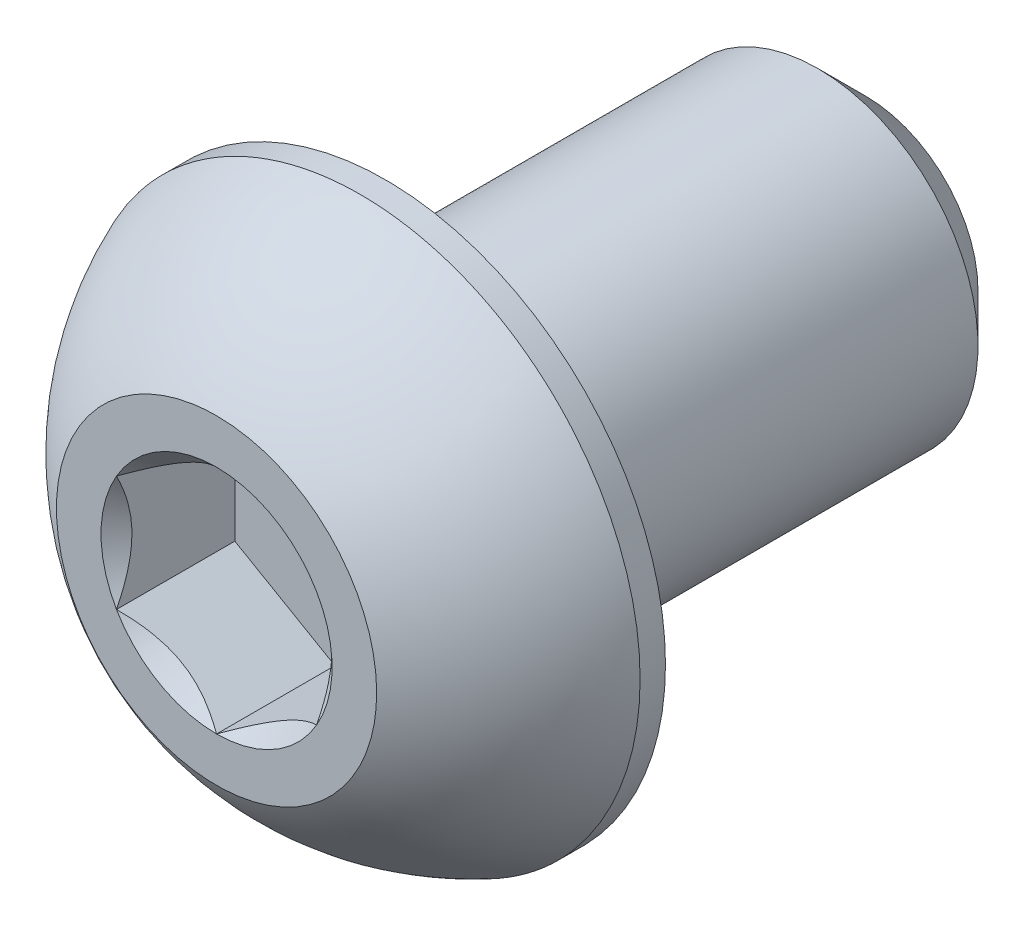
ISO-10303-21;
HEADER;
FILE_DESCRIPTION(('STEP AP214'),'2;1');
FILE_NAME('part.step','',(''),(''),'','','');
FILE_SCHEMA(('AUTOMOTIVE_DESIGN { 1 0 10303 214 1 1 1 1 }'));
ENDSEC;
DATA;
#1=APPLICATION_CONTEXT('core data for automotive mechanical design processes');
#2=APPLICATION_PROTOCOL_DEFINITION('international standard','automotive_design',2000,#1);
#3=PRODUCT_CONTEXT('',#1,'mechanical');
#4=PRODUCT('Part','Part','',(#3));
#5=PRODUCT_RELATED_PRODUCT_CATEGORY('part','',(#4));
#6=PRODUCT_DEFINITION_FORMATION('','',#4);
#7=PRODUCT_DEFINITION_CONTEXT('part definition',#1,'design');
#8=PRODUCT_DEFINITION('design','',#6,#7);
#9=PRODUCT_DEFINITION_SHAPE('','',#8);
#10=(LENGTH_UNIT() NAMED_UNIT(*) SI_UNIT(.MILLI.,.METRE.));
#11=(NAMED_UNIT(*) PLANE_ANGLE_UNIT() SI_UNIT($,.RADIAN.));
#12=(NAMED_UNIT(*) SI_UNIT($,.STERADIAN.) SOLID_ANGLE_UNIT());
#13=UNCERTAINTY_MEASURE_WITH_UNIT(LENGTH_MEASURE(1.E-05),#10,'distance_accuracy_value','');
#14=(GEOMETRIC_REPRESENTATION_CONTEXT(3) GLOBAL_UNCERTAINTY_ASSIGNED_CONTEXT((#13)) GLOBAL_UNIT_ASSIGNED_CONTEXT((#10,
#11,#12)) REPRESENTATION_CONTEXT('',''));
#15=CARTESIAN_POINT('',(0.,0.,0.));
#16=DIRECTION('',(0.,0.,1.));
#17=DIRECTION('',(1.,0.,0.));
#18=AXIS2_PLACEMENT_3D('',#15,#16,#17);
#19=CARTESIAN_POINT('',(1.98437500000015,-1.14567944042318,-2.34696));
#20=DIRECTION('',(0.,0.,1.));
#21=DIRECTION('',(1.,0.,0.));
#22=AXIS2_PLACEMENT_3D('',#19,#20,#21);
#23=PLANE('',#22);
#24=DIRECTION('',(0.,-1.,0.));
#25=VECTOR('',#24,1.);
#26=CARTESIAN_POINT('',(-1.98437500000001,1.14567944042318,-2.34696000000001));
#27=LINE('',#26,#25);
#28=CARTESIAN_POINT('',(-1.984375,1.14567944042315,-2.34696000000001));
#29=VERTEX_POINT('',#28);
#30=CARTESIAN_POINT('',(-1.98437500000001,-1.14567944042317,-2.34696000000001));
#31=VERTEX_POINT('',#30);
#32=EDGE_CURVE('E67',#29,#31,#27,.T.);
#33=ORIENTED_EDGE('',*,*,#32,.T.);
#34=DIRECTION('',(0.866025403784439,-0.5,0.));
#35=VECTOR('',#34,1.);
#36=CARTESIAN_POINT('',(-1.98437499999995,-1.14567944042318,-2.34696));
#37=LINE('',#36,#35);
#38=CARTESIAN_POINT('',(0.,-2.29135888084632,-2.34696));
#39=VERTEX_POINT('',#38);
#40=EDGE_CURVE('E81',#31,#39,#37,.T.);
#41=ORIENTED_EDGE('',*,*,#40,.T.);
#42=DIRECTION('',(0.866025403784438,0.500000000000001,0.));
#43=VECTOR('',#42,1.);
#44=CARTESIAN_POINT('',(0.,-2.29135888084632,-2.34696));
#45=LINE('',#44,#43);
#46=CARTESIAN_POINT('',(1.98437500000014,-1.14567944042314,-2.34696));
#47=VERTEX_POINT('',#46);
#48=EDGE_CURVE('E84',#39,#47,#45,.T.);
#49=ORIENTED_EDGE('',*,*,#48,.T.);
#50=DIRECTION('',(0.,1.,0.));
#51=VECTOR('',#50,1.);
#52=CARTESIAN_POINT('',(1.98437500000015,-1.14567944042318,-2.34696));
#53=LINE('',#52,#51);
#54=CARTESIAN_POINT('',(1.98437500000004,1.14567944042317,-2.34696));
#55=VERTEX_POINT('',#54);
#56=EDGE_CURVE('E94',#47,#55,#53,.T.);
#57=ORIENTED_EDGE('',*,*,#56,.T.);
#58=DIRECTION('',(-0.866025403784439,0.5,0.));
#59=VECTOR('',#58,1.);
#60=CARTESIAN_POINT('',(1.98437499999998,1.14567944042317,-2.34696));
#61=LINE('',#60,#59);
#62=CARTESIAN_POINT('',(0.,2.2913588808463,-2.34696000000001));
#63=VERTEX_POINT('',#62);
#64=EDGE_CURVE('E155',#55,#63,#61,.T.);
#65=ORIENTED_EDGE('',*,*,#64,.T.);
#66=DIRECTION('',(-0.866025403784438,-0.500000000000001,0.));
#67=VECTOR('',#66,1.);
#68=CARTESIAN_POINT('',(0.,2.29135888084633,-2.34696000000002));
#69=LINE('',#68,#67);
#70=EDGE_CURVE('E72',#63,#29,#69,.T.);
#71=ORIENTED_EDGE('',*,*,#70,.T.);
#72=EDGE_LOOP('',(#33,#41,#49,#57,#65,#71));
#73=FACE_BOUND('',#72,.T.);
#74=ADVANCED_FACE('F18',(#73),#23,.T.);
#75=CARTESIAN_POINT('',(-1.98437499999995,-1.14567944042318,-2.34696));
#76=DIRECTION('',(-0.5,-0.866025403784439,0.));
#77=DIRECTION('',(0.866025403784439,-0.5,0.));
#78=AXIS2_PLACEMENT_3D('',#75,#76,#77);
#79=PLANE('',#78);
#80=CARTESIAN_POINT('',(-1.98437499996113,-1.14567944044596,5.53590831692509E-11));
#81=CARTESIAN_POINT('',(-1.91617106208952,-1.1850570023357,-0.0393397719682902));
#82=CARTESIAN_POINT('',(-1.84682675297684,-1.22509295786858,-0.0763686714532534));
#83=CARTESIAN_POINT('',(-1.7054265904269,-1.30673037978017,-0.14416700563662));
#84=CARTESIAN_POINT('',(-1.63335729717463,-1.3483396056397,-0.174898729690736));
#85=CARTESIAN_POINT('',(-1.48803310239807,-1.43224256861373,-0.227542379771985));
#86=CARTESIAN_POINT('',(-1.41481519061645,-1.47451494969034,-0.249586587915512));
#87=CARTESIAN_POINT('',(-1.26676792251603,-1.5599900797809,-0.283549889195685));
#88=CARTESIAN_POINT('',(-1.19194308557701,-1.60319021952972,-0.295494325148714));
#89=CARTESIAN_POINT('',(-1.0629790320385,-1.67764765055596,-0.306271572343296));
#90=CARTESIAN_POINT('',(-1.00900630839731,-1.7088088170791,-0.307866471918129));
#91=CARTESIAN_POINT('',(-0.901149169201775,-1.77108016542767,-0.305176078479578));
#92=CARTESIAN_POINT('',(-0.847264791226896,-1.80219032555658,-0.300888724406291));
#93=CARTESIAN_POINT('',(-0.740004920177256,-1.86411684098033,-0.286677805648939));
#94=CARTESIAN_POINT('',(-0.686630064017393,-1.89493282855219,-0.276747939406714));
#95=CARTESIAN_POINT('',(-0.580803363116631,-1.95603190280469,-0.251797051416575));
#96=CARTESIAN_POINT('',(-0.528351447912644,-1.98631503016723,-0.236776420119124));
#97=CARTESIAN_POINT('',(-0.394030915897776,-2.0638650254837,-0.19219521086218));
#98=CARTESIAN_POINT('',(-0.312994309056721,-2.1106515322576,-0.15927786603087));
#99=CARTESIAN_POINT('',(-0.193836207809528,-2.17944749408879,-0.10371047949196));
#100=CARTESIAN_POINT('',(-0.154568167024551,-2.20211890800655,-0.0841869061260192));
#101=CARTESIAN_POINT('',(-0.076759172420062,-2.24704195198682,-0.0433602992331439));
#102=CARTESIAN_POINT('',(-0.0382177905088866,-2.26929382920818,-0.0220583562653107));
#103=CARTESIAN_POINT('',(-3.90387474774796E-11,-2.29135888082378,5.55226371469163E-11));
#104=B_SPLINE_CURVE_WITH_KNOTS('',3,(#80,#81,#82,#83,#84,#85,#86,#87,#88,#89,#90,#91,#92,#93,
#94,#95,#96,#97,#98,#99,#100,#101,#102,#103),.UNSPECIFIED.,.F.,.F.,(4,2,2,2,2,2,2,2,2,2,2,4),
(0.,0.264284909610382,0.530108996325592,0.791712695366179,1.05265800168076,1.2394215011033,
1.4262504565744,1.61328847387728,1.8003121490216,2.09727151171734,2.24534838932685,
2.39333511875249),.UNSPECIFIED.);
#105=CARTESIAN_POINT('',(-1.98437499996619,-1.14567944040367,3.90435785704199E-11));
#106=VERTEX_POINT('',#105);
#107=CARTESIAN_POINT('',(4.80738137425213E-11,-2.29135888079601,2.77548670291491E-11));
#108=VERTEX_POINT('',#107);
#109=EDGE_CURVE('E21',#106,#108,#104,.T.);
#110=ORIENTED_EDGE('',*,*,#109,.T.);
#111=DIRECTION('',(0.,0.,1.));
#112=VECTOR('',#111,1.);
#113=CARTESIAN_POINT('',(0.,-2.29135888084632,-2.34696));
#114=LINE('',#113,#112);
#115=EDGE_CURVE('E88',#108,#39,#114,.F.);
#116=ORIENTED_EDGE('',*,*,#115,.T.);
#117=ORIENTED_EDGE('',*,*,#40,.F.);
#118=DIRECTION('',(0.,0.,1.));
#119=VECTOR('',#118,1.);
#120=CARTESIAN_POINT('',(-1.98437500000001,-1.14567944042318,-2.34696000000001));
#121=LINE('',#120,#119);
#122=EDGE_CURVE('E59',#31,#106,#121,.T.);
#123=ORIENTED_EDGE('',*,*,#122,.T.);
#124=EDGE_LOOP('',(#110,#116,#117,#123));
#125=FACE_BOUND('',#124,.T.);
#126=ADVANCED_FACE('F89',(#125),#79,.F.);
#127=CARTESIAN_POINT('',(0.,-2.29135888084632,-2.34696));
#128=DIRECTION('',(0.500000000000001,-0.866025403784438,0.));
#129=DIRECTION('',(0.866025403784438,0.500000000000001,0.));
#130=AXIS2_PLACEMENT_3D('',#127,#128,#129);
#131=PLANE('',#130);
#132=CARTESIAN_POINT('',(3.91575770107944E-11,-2.29135888082407,5.53742249682677E-11));
#133=CARTESIAN_POINT('',(0.068203937910578,-2.25198131893398,-0.0393397719682822));
#134=CARTESIAN_POINT('',(0.137548247023185,-2.21194536340096,-0.0763686714532506));
#135=CARTESIAN_POINT('',(0.278948409573075,-2.13030794148925,-0.144167005636625));
#136=CARTESIAN_POINT('',(0.351017702825379,-2.08869871562975,-0.174898729690744));
#137=CARTESIAN_POINT('',(0.496341897601952,-2.00479575265575,-0.227542379771991));
#138=CARTESIAN_POINT('',(0.569559809383568,-1.96252337157913,-0.249586587915516));
#139=CARTESIAN_POINT('',(0.717607077483968,-1.87704824148857,-0.283549889195686));
#140=CARTESIAN_POINT('',(0.792431914422989,-1.83384810173976,-0.295494325148714));
#141=CARTESIAN_POINT('',(0.921395967961486,-1.75939067071352,-0.306271572343295));
#142=CARTESIAN_POINT('',(0.975368691602671,-1.72822950419038,-0.307866471918129));
#143=CARTESIAN_POINT('',(1.0832258307982,-1.66595815584182,-0.305176078479579));
#144=CARTESIAN_POINT('',(1.13711020877308,-1.63484799571291,-0.300888724406293));
#145=CARTESIAN_POINT('',(1.24437007982272,-1.57292148028915,-0.286677805648943));
#146=CARTESIAN_POINT('',(1.29774493598259,-1.5421054927173,-0.276747939406717));
#147=CARTESIAN_POINT('',(1.40357163688335,-1.48100641846479,-0.251797051416578));
#148=CARTESIAN_POINT('',(1.45602355208734,-1.45072329110226,-0.236776420119126));
#149=CARTESIAN_POINT('',(1.59034408410355,-1.37317329578501,-0.192195210861739));
#150=CARTESIAN_POINT('',(1.6713806909459,-1.32638678901036,-0.159277866029805));
#151=CARTESIAN_POINT('',(1.79053879219495,-1.2575908271781,-0.103710479489791));
#152=CARTESIAN_POINT('',(1.82980683298053,-1.23491941325999,-0.0841869061234554));
#153=CARTESIAN_POINT('',(1.90761582758621,-1.18999636927903,-0.0433602992297465));
#154=CARTESIAN_POINT('',(1.94615720949797,-1.16774449205734,-0.022058356261475));
#155=CARTESIAN_POINT('',(1.98437499996839,-1.1456794404414,5.98131242252754E-11));
#156=B_SPLINE_CURVE_WITH_KNOTS('',3,(#132,#133,#134,#135,#136,#137,#138,#139,#140,#141,#142,
#143,#144,#145,#146,#147,#148,#149,#150,#151,#152,#153,#154,#155),.UNSPECIFIED.,.F.,.F.,(4,2,2,
2,2,2,2,2,2,2,2,4),(0.,0.264284909610412,0.530108996325651,0.791712695366218,1.05265800168078,
1.23942150110331,1.4262504565744,1.61328847387729,1.80031214902162,2.09727151172217,
2.24534838933408,2.3933351187621),.UNSPECIFIED.);
#157=CARTESIAN_POINT('',(1.98437499998386,-1.14567944035432,2.96691945125649E-11));
#158=VERTEX_POINT('',#157);
#159=EDGE_CURVE('E199',#108,#158,#156,.T.);
#160=ORIENTED_EDGE('',*,*,#159,.T.);
#161=DIRECTION('',(0.,0.,1.));
#162=VECTOR('',#161,1.);
#163=CARTESIAN_POINT('',(1.98437500000015,-1.14567944042317,-2.34696));
#164=LINE('',#163,#162);
#165=EDGE_CURVE('E98',#158,#47,#164,.F.);
#166=ORIENTED_EDGE('',*,*,#165,.T.);
#167=ORIENTED_EDGE('',*,*,#48,.F.);
#168=ORIENTED_EDGE('',*,*,#115,.F.);
#169=EDGE_LOOP('',(#160,#166,#167,#168));
#170=FACE_BOUND('',#169,.T.);
#171=ADVANCED_FACE('F96',(#170),#131,.F.);
#172=CARTESIAN_POINT('',(1.98437500000015,-1.14567944042318,-2.34696));
#173=DIRECTION('',(1.,0.,0.));
#174=DIRECTION('',(0.,1.,0.));
#175=AXIS2_PLACEMENT_3D('',#172,#173,#174);
#176=PLANE('',#175);
#177=ORIENTED_EDGE('',*,*,#165,.F.);
#178=CARTESIAN_POINT('',(1.98437500000015,-1.14567944040829,1.39206491601629E-11));
#179=CARTESIAN_POINT('',(1.98437499999989,-1.06743880339701,-0.039083816313323));
#180=CARTESIAN_POINT('',(1.98437500000002,-0.987898318928285,-0.075885523088756));
#181=CARTESIAN_POINT('',(1.98437500000028,-0.825677042002386,-0.143343794927743));
#182=CARTESIAN_POINT('',(1.98437500000042,-0.742979382506015,-0.173959439319726));
#183=CARTESIAN_POINT('',(1.98437499999988,-0.575193959537607,-0.226826077097443));
#184=CARTESIAN_POINT('',(1.98437499999922,-0.490115359100477,-0.249105379119369));
#185=CARTESIAN_POINT('',(1.98437500000108,-0.318093091116875,-0.283405327707059));
#186=CARTESIAN_POINT('',(1.98437500000359,-0.231156054965337,-0.295457697637179));
#187=CARTESIAN_POINT('',(1.98437499999921,-0.119918521503129,-0.303508897285624));
#188=CARTESIAN_POINT('',(1.98437499999782,-0.0959468442982934,-0.304810524347571));
#189=CARTESIAN_POINT('',(1.98437500000248,-0.0479845644379657,-0.306548173625917));
#190=CARTESIAN_POINT('',(1.98437500000853,-0.0239939791573221,-0.306984666064257));
#191=CARTESIAN_POINT('',(1.98437500001843,0.0602201717453234,-0.306981909846599));
#192=CARTESIAN_POINT('',(1.98437500000515,0.120461721904622,-0.304225476926114));
#193=CARTESIAN_POINT('',(1.98437499999514,0.240474970988012,-0.293363448671785));
#194=CARTESIAN_POINT('',(1.98437499999841,0.300246312757291,-0.28525412242529));
#195=CARTESIAN_POINT('',(1.98437500000364,0.47876375280352,-0.253403770455282));
#196=CARTESIAN_POINT('',(1.98437500000096,0.596208828937264,-0.222145773806493));
#197=CARTESIAN_POINT('',(1.98437499999962,0.785921487432625,-0.158199964003356));
#198=CARTESIAN_POINT('',(1.98437499999988,0.859734609850088,-0.129765422243818));
#199=CARTESIAN_POINT('',(1.98437500000041,1.00456595515974,-0.0681385959297623));
#200=CARTESIAN_POINT('',(1.98437500000067,1.07560356652985,-0.0349922069391345));
#201=CARTESIAN_POINT('',(1.98437500000015,1.14567944039822,8.88291537603352E-12));
#202=B_SPLINE_CURVE_WITH_KNOTS('',3,(#178,#179,#180,#181,#182,#183,#184,#185,#186,#187,#188,
#189,#190,#191,#192,#193,#194,#195,#196,#197,#198,#199,#200,#201),.UNSPECIFIED.,.F.,.F.,(4,2,2,
2,2,2,2,2,2,2,2,4),(0.,0.262559005195411,0.526801735815133,0.790138824377003,1.05265603858338,
1.12466619178191,1.19663719494664,1.37727026722056,1.55802937204925,1.92104085085962,
2.15819130085229,2.39317265068751),.UNSPECIFIED.);
#203=CARTESIAN_POINT('',(1.98437499993238,1.14567944046219,1.06066558611253E-11));
#204=VERTEX_POINT('',#203);
#205=EDGE_CURVE('E177',#158,#204,#202,.T.);
#206=ORIENTED_EDGE('',*,*,#205,.T.);
#207=DIRECTION('',(0.,0.,1.));
#208=VECTOR('',#207,1.);
#209=CARTESIAN_POINT('',(1.98437499999998,1.14567944042317,-2.34696));
#210=LINE('',#209,#208);
#211=EDGE_CURVE('E152',#204,#55,#210,.F.);
#212=ORIENTED_EDGE('',*,*,#211,.T.);
#213=ORIENTED_EDGE('',*,*,#56,.F.);
#214=EDGE_LOOP('',(#177,#206,#212,#213));
#215=FACE_BOUND('',#214,.T.);
#216=ADVANCED_FACE('F176',(#215),#176,.F.);
#217=CARTESIAN_POINT('',(1.98437499999998,1.14567944042317,-2.34696));
#218=DIRECTION('',(0.5,0.866025403784439,0.));
#219=DIRECTION('',(-0.866025403784439,0.5,0.));
#220=AXIS2_PLACEMENT_3D('',#217,#218,#219);
#221=PLANE('',#220);
#222=CARTESIAN_POINT('',(1.98437499996299,1.14567944045163,5.15505898264042E-11));
#223=CARTESIAN_POINT('',(1.9161710620888,1.18505700233854,-0.0393397719703968));
#224=CARTESIAN_POINT('',(1.84682675297503,1.22509295787027,-0.07636867145463));
#225=CARTESIAN_POINT('',(1.7054265904242,1.30673037978107,-0.144167005637394));
#226=CARTESIAN_POINT('',(1.63335729717213,1.34833960564097,-0.174898729691639));
#227=CARTESIAN_POINT('',(1.48803310239559,1.43224256861534,-0.227542379772883));
#228=CARTESIAN_POINT('',(1.41481519061377,1.47451494969193,-0.249586587916278));
#229=CARTESIAN_POINT('',(1.2667679225131,1.55999007978255,-0.2835498891962));
#230=CARTESIAN_POINT('',(1.19194308557401,1.60319021953144,-0.295494325149112));
#231=CARTESIAN_POINT('',(1.06297903203536,1.67764765055779,-0.306271572343449));
#232=CARTESIAN_POINT('',(1.0090063083941,1.70880881708096,-0.307866471918167));
#233=CARTESIAN_POINT('',(0.901149169198434,1.7710801654296,-0.305176078479373));
#234=CARTESIAN_POINT('',(0.847264791223494,1.80219032555854,-0.300888724405961));
#235=CARTESIAN_POINT('',(0.740004920173754,1.86411684098236,-0.286677805648352));
#236=CARTESIAN_POINT('',(0.68663006401385,1.89493282855423,-0.276747939405996));
#237=CARTESIAN_POINT('',(0.580803363113016,1.95603190280678,-0.251797051415601));
#238=CARTESIAN_POINT('',(0.528351447908998,1.98631503016933,-0.236776420118024));
#239=CARTESIAN_POINT('',(0.394030915894765,2.06386502548544,-0.192195210861));
#240=CARTESIAN_POINT('',(0.312994309054356,2.11065153225897,-0.159277866029836));
#241=CARTESIAN_POINT('',(0.193836207808087,2.17944749408963,-0.10371047949125));
#242=CARTESIAN_POINT('',(0.154568167023408,2.20211890800721,-0.0841869061254333));
#243=CARTESIAN_POINT('',(0.0767591724195024,2.24704195198715,-0.0433602992328332));
#244=CARTESIAN_POINT('',(0.0382177905086133,2.26929382920834,-0.0220583562651516));
#245=CARTESIAN_POINT('',(3.9047189461392E-11,2.29135888082378,5.55197019446748E-11));
#246=B_SPLINE_CURVE_WITH_KNOTS('',3,(#222,#223,#224,#225,#226,#227,#228,#229,#230,#231,#232,
#233,#234,#235,#236,#237,#238,#239,#240,#241,#242,#243,#244,#245),.UNSPECIFIED.,.F.,.F.,(4,2,2,
2,2,2,2,2,2,2,2,4),(0.,0.264284909610474,0.530108996325887,0.791712695366782,1.05265800168162,
1.23942150110438,1.42625045657572,1.6132884738788,1.80031214902332,2.09727151171681,
2.24534838932523,2.39333511874978),.UNSPECIFIED.);
#247=CARTESIAN_POINT('',(-4.80404261260634E-11,2.29135888079601,2.77535217673844E-11));
#248=VERTEX_POINT('',#247);
#249=EDGE_CURVE('E182',#204,#248,#246,.T.);
#250=ORIENTED_EDGE('',*,*,#249,.T.);
#251=DIRECTION('',(0.,0.,1.));
#252=VECTOR('',#251,1.);
#253=CARTESIAN_POINT('',(0.,2.29135888084629,-2.34696000000002));
#254=LINE('',#253,#252);
#255=EDGE_CURVE('E147',#248,#63,#254,.F.);
#256=ORIENTED_EDGE('',*,*,#255,.T.);
#257=ORIENTED_EDGE('',*,*,#64,.F.);
#258=ORIENTED_EDGE('',*,*,#211,.F.);
#259=EDGE_LOOP('',(#250,#256,#257,#258));
#260=FACE_BOUND('',#259,.T.);
#261=ADVANCED_FACE('F180',(#260),#221,.F.);
#262=CARTESIAN_POINT('',(0.,2.29135888084633,-2.34696000000002));
#263=DIRECTION('',(-0.500000000000001,0.866025403784438,0.));
#264=DIRECTION('',(-0.866025403784438,-0.500000000000001,0.));
#265=AXIS2_PLACEMENT_3D('',#262,#263,#264);
#266=PLANE('',#265);
#267=CARTESIAN_POINT('',(-3.91396306102029E-11,2.29135888082406,5.53480220677037E-11));
#268=CARTESIAN_POINT('',(-0.0682039379105523,2.25198131893397,-0.0393397719683034));
#269=CARTESIAN_POINT('',(-0.137548247023152,2.21194536340094,-0.0763686714532683));
#270=CARTESIAN_POINT('',(-0.27894840957303,2.13030794148924,-0.144167005636639));
#271=CARTESIAN_POINT('',(-0.351017702825327,2.08869871562975,-0.174898729690756));
#272=CARTESIAN_POINT('',(-0.496341897601902,2.00479575265575,-0.227542379772008));
#273=CARTESIAN_POINT('',(-0.569559809383524,1.96252337157912,-0.249586587915538));
#274=CARTESIAN_POINT('',(-0.71760707748394,1.87704824148855,-0.283549889195714));
#275=CARTESIAN_POINT('',(-0.792431914422968,1.83384810173973,-0.295494325148743));
#276=CARTESIAN_POINT('',(-0.921395967961475,1.75939067071349,-0.306271572343326));
#277=CARTESIAN_POINT('',(-0.975368691602662,1.72822950419035,-0.307866471918159));
#278=CARTESIAN_POINT('',(-1.0832258307982,1.66595815584179,-0.305176078479609));
#279=CARTESIAN_POINT('',(-1.13711020877308,1.63484799571288,-0.300888724406322));
#280=CARTESIAN_POINT('',(-1.24437007982272,1.57292148028912,-0.286677805648971));
#281=CARTESIAN_POINT('',(-1.29774493598258,1.54210549271727,-0.276747939406745));
#282=CARTESIAN_POINT('',(-1.40357163688334,1.48100641846476,-0.251797051416607));
#283=CARTESIAN_POINT('',(-1.45602355208732,1.45072329110223,-0.236776420119156));
#284=CARTESIAN_POINT('',(-1.59034408410219,1.37317329578575,-0.192195210862213));
#285=CARTESIAN_POINT('',(-1.67138069094325,1.32638678901185,-0.159277866030901));
#286=CARTESIAN_POINT('',(-1.79053879219045,1.25759082718066,-0.103710479491989));
#287=CARTESIAN_POINT('',(-1.82980683297543,1.2349194132629,-0.0841869061260472));
#288=CARTESIAN_POINT('',(-1.90761582757992,1.18999636928263,-0.0433602992331702));
#289=CARTESIAN_POINT('',(-1.94615720949109,1.16774449206127,-0.0220583562653362));
#290=CARTESIAN_POINT('',(-1.98437499996094,1.14567944044567,5.54981098961618E-11));
#291=B_SPLINE_CURVE_WITH_KNOTS('',3,(#267,#268,#269,#270,#271,#272,#273,#274,#275,#276,#277,
#278,#279,#280,#281,#282,#283,#284,#285,#286,#287,#288,#289,#290),.UNSPECIFIED.,.F.,.F.,(4,2,2,
2,2,2,2,2,2,2,2,4),(0.,0.26428490961039,0.530108996325607,0.791712695366202,1.05265800168079,
1.23942150110333,1.42625045657443,1.61328847387731,1.80031214902163,2.09727151171737,
2.24534838932688,2.39333511875253),.UNSPECIFIED.);
#292=CARTESIAN_POINT('',(-1.98437499998047,1.14567944035634,2.77424179812592E-11));
#293=VERTEX_POINT('',#292);
#294=EDGE_CURVE('E40',#248,#293,#291,.T.);
#295=ORIENTED_EDGE('',*,*,#294,.T.);
#296=DIRECTION('',(0.,0.,1.));
#297=VECTOR('',#296,1.);
#298=CARTESIAN_POINT('',(-1.98437500000001,1.14567944042317,-2.34696000000001));
#299=LINE('',#298,#297);
#300=EDGE_CURVE('E140',#293,#29,#299,.F.);
#301=ORIENTED_EDGE('',*,*,#300,.T.);
#302=ORIENTED_EDGE('',*,*,#70,.F.);
#303=ORIENTED_EDGE('',*,*,#255,.F.);
#304=EDGE_LOOP('',(#295,#301,#302,#303));
#305=FACE_BOUND('',#304,.T.);
#306=ADVANCED_FACE('F184',(#305),#266,.F.);
#307=CARTESIAN_POINT('',(-1.98437500000001,1.14567944042318,-2.34696000000001));
#308=DIRECTION('',(-1.,0.,0.));
#309=DIRECTION('',(0.,-1.,0.));
#310=AXIS2_PLACEMENT_3D('',#307,#308,#309);
#311=PLANE('',#310);
#312=CARTESIAN_POINT('',(-1.98437500000031,1.14567944037812,5.53910604140391E-11));
#313=CARTESIAN_POINT('',(-1.98437500000012,1.0669243165983,-0.0393397719682639));
#314=CARTESIAN_POINT('',(-1.98437500000004,0.986852405532395,-0.0763686714532295));
#315=CARTESIAN_POINT('',(-1.98437499999998,0.823577561709106,-0.144167005636599));
#316=CARTESIAN_POINT('',(-1.984375,0.74035910999008,-0.174898729690714));
#317=CARTESIAN_POINT('',(-1.98437500000002,0.57255318404205,-0.227542379771963));
#318=CARTESIAN_POINT('',(-1.98437500000001,0.488008421888804,-0.249586587915492));
#319=CARTESIAN_POINT('',(-1.98437500000001,0.317058161707679,-0.283549889195666));
#320=CARTESIAN_POINT('',(-1.98437500000001,0.230657882210046,-0.295494325148695));
#321=CARTESIAN_POINT('',(-1.98437500000001,0.0817430201575621,-0.306271572343277));
#322=CARTESIAN_POINT('',(-1.98437500000001,0.0194206871112873,-0.307866471918111));
#323=CARTESIAN_POINT('',(-1.98437500000001,-0.105122009585845,-0.305176078479561));
#324=CARTESIAN_POINT('',(-1.98437500000001,-0.16734232984367,-0.300888724406275));
#325=CARTESIAN_POINT('',(-1.98437500000001,-0.291195360691179,-0.286677805648924));
#326=CARTESIAN_POINT('',(-1.98437500000001,-0.352827335834889,-0.276747939406698));
#327=CARTESIAN_POINT('',(-1.98437500000001,-0.475025484339899,-0.25179705141656));
#328=CARTESIAN_POINT('',(-1.98437500000001,-0.535591739064966,-0.236776420119108));
#329=CARTESIAN_POINT('',(-1.98437500000001,-0.690691729697926,-0.192195210862165));
#330=CARTESIAN_POINT('',(-1.98437500000001,-0.784264743245722,-0.159277866030853));
#331=CARTESIAN_POINT('',(-1.98437500000001,-0.921856666908111,-0.103710479491942));
#332=CARTESIAN_POINT('',(-1.98437500000001,-0.967199494743623,-0.0841869061260007));
#333=CARTESIAN_POINT('',(-1.98437500000001,-1.05704558270418,-0.0433602992331242));
#334=CARTESIAN_POINT('',(-1.98437500000001,-1.10154933714689,-0.0220583562652904));
#335=CARTESIAN_POINT('',(-1.98437500000001,-1.14567944037809,5.5544138978114E-11));
#336=B_SPLINE_CURVE_WITH_KNOTS('',3,(#312,#313,#314,#315,#316,#317,#318,#319,#320,#321,#322,
#323,#324,#325,#326,#327,#328,#329,#330,#331,#332,#333,#334,#335),.UNSPECIFIED.,.F.,.F.,(4,2,2,
2,2,2,2,2,2,2,2,4),(0.,0.264284909610386,0.530108996325597,0.791712695366185,1.05265800168077,
1.23942150110331,1.42625045657441,1.6132884738773,1.80031214902162,2.09727151171736,
2.24534838932688,2.39333511875252),.UNSPECIFIED.);
#337=EDGE_CURVE('E189',#293,#106,#336,.T.);
#338=ORIENTED_EDGE('',*,*,#337,.T.);
#339=ORIENTED_EDGE('',*,*,#122,.F.);
#340=ORIENTED_EDGE('',*,*,#32,.F.);
#341=ORIENTED_EDGE('',*,*,#300,.F.);
#342=EDGE_LOOP('',(#338,#339,#340,#341));
#343=FACE_BOUND('',#342,.T.);
#344=ADVANCED_FACE('F187',(#343),#311,.F.);
#345=CARTESIAN_POINT('',(0.,0.,0.));
#346=DIRECTION('',(0.,0.,1.));
#347=DIRECTION('',(1.,0.,0.));
#348=AXIS2_PLACEMENT_3D('',#345,#346,#347);
#349=CONICAL_SURFACE('',#348,2.29135888076826,0.785398163397448);
#350=ORIENTED_EDGE('',*,*,#109,.F.);
#351=CARTESIAN_POINT('',(0.,0.,0.));
#352=DIRECTION('',(0.,0.,1.));
#353=DIRECTION('',(1.,0.,0.));
#354=AXIS2_PLACEMENT_3D('',#351,#352,#353);
#355=CIRCLE('',#354,2.29135888076826);
#356=EDGE_CURVE('E193',#106,#108,#355,.T.);
#357=ORIENTED_EDGE('',*,*,#356,.T.);
#358=EDGE_LOOP('',(#350,#357));
#359=FACE_BOUND('',#358,.T.);
#360=ADVANCED_FACE('F196',(#359),#349,.F.);
#361=CARTESIAN_POINT('',(0.,0.,0.));
#362=DIRECTION('',(0.,0.,1.));
#363=DIRECTION('',(1.,0.,0.));
#364=AXIS2_PLACEMENT_3D('',#361,#362,#363);
#365=CONICAL_SURFACE('',#364,2.29135888076826,0.785398163397448);
#366=ORIENTED_EDGE('',*,*,#159,.F.);
#367=CARTESIAN_POINT('',(0.,0.,0.));
#368=DIRECTION('',(0.,0.,1.));
#369=DIRECTION('',(1.,0.,0.));
#370=AXIS2_PLACEMENT_3D('',#367,#368,#369);
#371=CIRCLE('',#370,2.29135888076826);
#372=EDGE_CURVE('E207',#108,#158,#371,.T.);
#373=ORIENTED_EDGE('',*,*,#372,.T.);
#374=EDGE_LOOP('',(#366,#373));
#375=FACE_BOUND('',#374,.T.);
#376=ADVANCED_FACE('F260',(#375),#365,.F.);
#377=CARTESIAN_POINT('',(0.,0.,5.68432695841555E-11));
#378=DIRECTION('',(0.,0.,1.));
#379=DIRECTION('',(1.,0.,0.));
#380=AXIS2_PLACEMENT_3D('',#377,#378,#379);
#381=CONICAL_SURFACE('',#380,2.29135888088194,0.78539816348948);
#382=ORIENTED_EDGE('',*,*,#205,.F.);
#383=CARTESIAN_POINT('',(0.,0.,-5.6843568116535E-11));
#384=DIRECTION('',(0.,0.,1.));
#385=DIRECTION('',(1.,0.,0.));
#386=AXIS2_PLACEMENT_3D('',#383,#384,#385);
#387=CIRCLE('',#386,2.29135888076826);
#388=EDGE_CURVE('E209',#158,#204,#387,.T.);
#389=ORIENTED_EDGE('',*,*,#388,.T.);
#390=EDGE_LOOP('',(#382,#389));
#391=FACE_BOUND('',#390,.T.);
#392=ADVANCED_FACE('F235',(#391),#381,.F.);
#393=CARTESIAN_POINT('',(0.,0.,0.));
#394=DIRECTION('',(0.,0.,1.));
#395=DIRECTION('',(1.,0.,0.));
#396=AXIS2_PLACEMENT_3D('',#393,#394,#395);
#397=CONICAL_SURFACE('',#396,2.29135888076826,0.785398163397448);
#398=ORIENTED_EDGE('',*,*,#249,.F.);
#399=CARTESIAN_POINT('',(0.,0.,0.));
#400=DIRECTION('',(0.,0.,1.));
#401=DIRECTION('',(1.,0.,0.));
#402=AXIS2_PLACEMENT_3D('',#399,#400,#401);
#403=CIRCLE('',#402,2.29135888076826);
#404=EDGE_CURVE('E377',#204,#248,#403,.T.);
#405=ORIENTED_EDGE('',*,*,#404,.T.);
#406=EDGE_LOOP('',(#398,#405));
#407=FACE_BOUND('',#406,.T.);
#408=ADVANCED_FACE('F230',(#407),#397,.F.);
#409=CARTESIAN_POINT('',(0.,0.,0.));
#410=DIRECTION('',(0.,0.,1.));
#411=DIRECTION('',(1.,0.,0.));
#412=AXIS2_PLACEMENT_3D('',#409,#410,#411);
#413=CONICAL_SURFACE('',#412,2.29135888076826,0.785398163397448);
#414=ORIENTED_EDGE('',*,*,#294,.F.);
#415=CARTESIAN_POINT('',(0.,0.,0.));
#416=DIRECTION('',(0.,0.,1.));
#417=DIRECTION('',(1.,0.,0.));
#418=AXIS2_PLACEMENT_3D('',#415,#416,#417);
#419=CIRCLE('',#418,2.29135888076826);
#420=EDGE_CURVE('E203',#248,#293,#419,.T.);
#421=ORIENTED_EDGE('',*,*,#420,.T.);
#422=EDGE_LOOP('',(#414,#421));
#423=FACE_BOUND('',#422,.T.);
#424=ADVANCED_FACE('F226',(#423),#413,.F.);
#425=CARTESIAN_POINT('',(0.,0.,0.));
#426=DIRECTION('',(0.,0.,1.));
#427=DIRECTION('',(1.,0.,0.));
#428=AXIS2_PLACEMENT_3D('',#425,#426,#427);
#429=CONICAL_SURFACE('',#428,2.29135888076826,0.785398163397448);
#430=ORIENTED_EDGE('',*,*,#337,.F.);
#431=CARTESIAN_POINT('',(0.,0.,0.));
#432=DIRECTION('',(0.,0.,1.));
#433=DIRECTION('',(1.,0.,0.));
#434=AXIS2_PLACEMENT_3D('',#431,#432,#433);
#435=CIRCLE('',#434,2.29135888076826);
#436=EDGE_CURVE('E125',#293,#106,#435,.T.);
#437=ORIENTED_EDGE('',*,*,#436,.T.);
#438=EDGE_LOOP('',(#430,#437));
#439=FACE_BOUND('',#438,.T.);
#440=ADVANCED_FACE('F200',(#439),#429,.F.);
#441=CARTESIAN_POINT('',(0.,-3.17500000000001,0.));
#442=DIRECTION('',(0.,0.,-1.));
#443=DIRECTION('',(-1.,0.,0.));
#444=AXIS2_PLACEMENT_3D('',#441,#442,#443);
#445=PLANE('',#444);
#446=CARTESIAN_POINT('',(0.,3.17500000000003,0.));
#447=CARTESIAN_POINT('',(0.0891440431949499,3.17499946578891,0.));
#448=CARTESIAN_POINT('',(0.178304469015882,3.17124231565253,0.));
#449=CARTESIAN_POINT('',(0.356009167569893,3.15623814187873,0.));
#450=CARTESIAN_POINT('',(0.444553250594669,3.14498890699604,0.));
#451=CARTESIAN_POINT('',(0.620528053473815,3.11505117443577,0.));
#452=CARTESIAN_POINT('',(0.707956777537969,3.09635086777695,0.));
#453=CARTESIAN_POINT('',(0.880976698268358,3.05163989606077,0.));
#454=CARTESIAN_POINT('',(0.966566342844974,3.02562329860023,0.));
#455=CARTESIAN_POINT('',(1.21929335585574,2.9369587636496,0.));
#456=CARTESIAN_POINT('',(1.38281412178584,2.86362325594719,0.));
#457=CARTESIAN_POINT('',(1.69520451443577,2.69050145233539,0.));
#458=CARTESIAN_POINT('',(1.84407358390853,2.59071415091926,0.));
#459=CARTESIAN_POINT('',(2.05315401206347,2.42346612457971,0.));
#460=CARTESIAN_POINT('',(2.12051634455461,2.36474478022378,0.));
#461=CARTESIAN_POINT('',(2.25000832852247,2.24188241400897,0.));
#462=CARTESIAN_POINT('',(2.31214296247269,2.17774667212205,0.));
#463=CARTESIAN_POINT('',(2.43081557069391,2.04443811228704,0.));
#464=CARTESIAN_POINT('',(2.4873509969749,1.97526302574649,0.));
#465=CARTESIAN_POINT('',(2.59439910403858,1.83240238976688,0.));
#466=CARTESIAN_POINT('',(2.64491038685251,1.7587157993644,0.));
#467=CARTESIAN_POINT('',(2.78681055610984,1.53169224589857,0.));
#468=CARTESIAN_POINT('',(2.86869094579922,1.37225061911434,0.));
#469=CARTESIAN_POINT('',(3.00447172394578,1.04196980448606,0.));
#470=CARTESIAN_POINT('',(3.05837241123926,0.871130738393969,0.));
#471=CARTESIAN_POINT('',(3.1367417696113,0.522806235086442,0.));
#472=CARTESIAN_POINT('',(3.16121028350956,0.345320762381588,0.));
#473=CARTESIAN_POINT('',(3.17999537369746,-0.0112387170595396,0.));
#474=CARTESIAN_POINT('',(3.1743119499871,-0.190312723795813,0.));
#475=CARTESIAN_POINT('',(3.13297731868486,-0.544943749216868,0.));
#476=CARTESIAN_POINT('',(3.09732627113225,-0.720500786678567,0.));
#477=CARTESIAN_POINT('',(2.99700206831939,-1.06322062934248,0.));
#478=CARTESIAN_POINT('',(2.93232860308384,-1.23038334486753,0.));
#479=CARTESIAN_POINT('',(2.81506892595035,-1.47106055604894,0.));
#480=CARTESIAN_POINT('',(2.77258003218358,-1.54964679659478,0.));
#481=CARTESIAN_POINT('',(2.68113589554004,-1.70296485949649,0.));
#482=CARTESIAN_POINT('',(2.63218215227428,-1.7776975701588,0.));
#483=CARTESIAN_POINT('',(2.52817416346671,-1.92273790362337,0.));
#484=CARTESIAN_POINT('',(2.47312269018629,-1.99304751472434,0.));
#485=CARTESIAN_POINT('',(2.35725756637542,-2.12883635089331,0.));
#486=CARTESIAN_POINT('',(2.29643840615053,-2.19431084876198,0.));
#487=CARTESIAN_POINT('',(2.10608934285423,-2.38260254229664,0.));
#488=CARTESIAN_POINT('',(1.96852974551873,-2.49748014041958,0.));
#489=CARTESIAN_POINT('',(1.67605983081152,-2.70246859203803,0.));
#490=CARTESIAN_POINT('',(1.52115017325758,-2.79258038692006,0.));
#491=CARTESIAN_POINT('',(1.27913883380202,-2.90730987065584,0.));
#492=CARTESIAN_POINT('',(1.19675675066645,-2.94217594270904,0.));
#493=CARTESIAN_POINT('',(1.02939274539446,-3.00481980673954,0.));
#494=CARTESIAN_POINT('',(0.944412990114346,-3.03260333518991,0.));
#495=CARTESIAN_POINT('',(0.772558133517363,-3.08086623339583,0.));
#496=CARTESIAN_POINT('',(0.685686257794105,-3.10135713704763,0.));
#497=CARTESIAN_POINT('',(0.51054190903417,-3.13495091945248,0.));
#498=CARTESIAN_POINT('',(0.422269857006534,-3.14805597727561,0.));
#499=CARTESIAN_POINT('',(0.27821749218824,-3.16327769663081,0.));
#500=CARTESIAN_POINT('',(0.222667817423166,-3.16767216929778,0.));
#501=CARTESIAN_POINT('',(0.111414227898883,-3.17353348790924,0.));
#502=CARTESIAN_POINT('',(0.0557103131396735,-3.17500033385374,0.));
#503=CARTESIAN_POINT('',(-0.0891440431949492,-3.17499946578891,0.));
#504=CARTESIAN_POINT('',(-0.178304469015881,-3.17124231565253,0.));
#505=CARTESIAN_POINT('',(-0.356009167569893,-3.15623814187873,0.));
#506=CARTESIAN_POINT('',(-0.444553250594669,-3.14498890699604,0.));
#507=CARTESIAN_POINT('',(-0.620528053473815,-3.11505117443577,0.));
#508=CARTESIAN_POINT('',(-0.707956777537968,-3.09635086777695,0.));
#509=CARTESIAN_POINT('',(-0.880976698268357,-3.05163989606076,0.));
#510=CARTESIAN_POINT('',(-0.966566342844974,-3.02562329860023,0.));
#511=CARTESIAN_POINT('',(-1.21929335585574,-2.9369587636496,0.));
#512=CARTESIAN_POINT('',(-1.38281412178584,-2.86362325594719,0.));
#513=CARTESIAN_POINT('',(-1.69520451443577,-2.69050145233539,0.));
#514=CARTESIAN_POINT('',(-1.84407358390853,-2.59071415091926,0.));
#515=CARTESIAN_POINT('',(-2.05315401206347,-2.4234661245797,0.));
#516=CARTESIAN_POINT('',(-2.12051634455461,-2.36474478022378,0.));
#517=CARTESIAN_POINT('',(-2.25000832852247,-2.24188241400897,0.));
#518=CARTESIAN_POINT('',(-2.31214296247269,-2.17774667212204,0.));
#519=CARTESIAN_POINT('',(-2.43081557069391,-2.04443811228704,0.));
#520=CARTESIAN_POINT('',(-2.4873509969749,-1.97526302574649,0.));
#521=CARTESIAN_POINT('',(-2.59439910403858,-1.83240238976688,0.));
#522=CARTESIAN_POINT('',(-2.64491038685251,-1.7587157993644,0.));
#523=CARTESIAN_POINT('',(-2.78681055610985,-1.53169224589857,0.));
#524=CARTESIAN_POINT('',(-2.86869094579922,-1.37225061911434,0.));
#525=CARTESIAN_POINT('',(-3.00447172394578,-1.04196980448606,0.));
#526=CARTESIAN_POINT('',(-3.05837241123926,-0.871130738393968,0.));
#527=CARTESIAN_POINT('',(-3.1367417696113,-0.52280623508644,0.));
#528=CARTESIAN_POINT('',(-3.16121028350955,-0.345320762381587,0.));
#529=CARTESIAN_POINT('',(-3.17999537369746,0.0112387170595405,0.));
#530=CARTESIAN_POINT('',(-3.1743119499871,0.190312723795814,0.));
#531=CARTESIAN_POINT('',(-3.13297731868486,0.544943749216868,0.));
#532=CARTESIAN_POINT('',(-3.09732627113225,0.720500786678567,0.));
#533=CARTESIAN_POINT('',(-2.99700206831939,1.06322062934248,0.));
#534=CARTESIAN_POINT('',(-2.93232860308385,1.23038334486753,0.));
#535=CARTESIAN_POINT('',(-2.81506892595035,1.47106055604894,0.));
#536=CARTESIAN_POINT('',(-2.77258003218358,1.54964679659478,0.));
#537=CARTESIAN_POINT('',(-2.68113589554004,1.70296485949649,0.));
#538=CARTESIAN_POINT('',(-2.63218215227428,1.7776975701588,0.));
#539=CARTESIAN_POINT('',(-2.52817416346671,1.92273790362337,0.));
#540=CARTESIAN_POINT('',(-2.47312269018629,1.99304751472434,0.));
#541=CARTESIAN_POINT('',(-2.35725756637541,2.12883635089331,0.));
#542=CARTESIAN_POINT('',(-2.29643840615053,2.19431084876198,0.));
#543=CARTESIAN_POINT('',(-2.10608934285422,2.38260254229663,0.));
#544=CARTESIAN_POINT('',(-1.96852974551873,2.49748014041958,0.));
#545=CARTESIAN_POINT('',(-1.67605983081151,2.70246859203803,0.));
#546=CARTESIAN_POINT('',(-1.52115017325757,2.79258038692005,0.));
#547=CARTESIAN_POINT('',(-1.27913883380201,2.90730987065584,0.));
#548=CARTESIAN_POINT('',(-1.19675675066645,2.94217594270904,0.));
#549=CARTESIAN_POINT('',(-1.02939274539445,3.00481980673955,0.));
#550=CARTESIAN_POINT('',(-0.944412990114342,3.03260333518991,0.));
#551=CARTESIAN_POINT('',(-0.77255813351736,3.08086623339583,0.));
#552=CARTESIAN_POINT('',(-0.685686257794102,3.10135713704763,0.));
#553=CARTESIAN_POINT('',(-0.510541909034168,3.13495091945248,0.));
#554=CARTESIAN_POINT('',(-0.422269857006531,3.14805597727561,0.));
#555=CARTESIAN_POINT('',(-0.278217492188238,3.16327769663081,0.));
#556=CARTESIAN_POINT('',(-0.222667817423164,3.16767216929777,0.));
#557=CARTESIAN_POINT('',(-0.111414227898882,3.17353348790924,0.));
#558=CARTESIAN_POINT('',(-0.0557103131396725,3.17500033385373,0.));
#559=CARTESIAN_POINT('',(0.,3.17500000000003,0.));
#560=B_SPLINE_CURVE_WITH_KNOTS('',3,(#446,#447,#448,#449,#450,#451,#452,#453,#454,#455,#456,
#457,#458,#459,#460,#461,#462,#463,#464,#465,#466,#467,#468,#469,#470,#471,#472,#473,#474,#475,
#476,#477,#478,#479,#480,#481,#482,#483,#484,#485,#486,#487,#488,#489,#490,#491,#492,#493,#494,
#495,#496,#497,#498,#499,#500,#501,#502,#503,#504,#505,#506,#507,#508,#509,#510,#511,#512,#513,
#514,#515,#516,#517,#518,#519,#520,#521,#522,#523,#524,#525,#526,#527,#528,#529,#530,#531,#532,
#533,#534,#535,#536,#537,#538,#539,#540,#541,#542,#543,#544,#545,#546,#547,#548,#549,#550,#551,
#552,#553,#554,#555,#556,#557,#558,#559),.UNSPECIFIED.,.T.,.F.,(4,2,2,2,2,2,2,2,2,2,2,2,2,2,2,2,
2,2,2,2,2,2,2,2,2,2,2,2,2,2,2,2,2,2,2,2,2,2,2,2,2,2,2,2,2,2,2,2,2,2,2,2,2,2,2,2,4),(0.,
0.267380842961495,0.534840636818121,0.80272601661562,1.07082924029341,1.60575767125612,
2.14070643926298,2.40853131463282,2.67609796648423,2.94378582378518,3.21153568062231,
3.74647713687891,4.28141287959315,4.81635147907863,5.3512900785641,5.88622582127835,
6.42116727753495,6.68891713437208,6.95660499167302,7.22417164352443,7.49199651889427,
8.02694528690113,8.56187371786385,8.82997694154163,9.09786232133913,9.36532211519576,
9.63270295815725,9.79980184614853,9.96690073413981,10.2342815771013,10.5017413709579,
10.7696267507554,11.0377299744332,11.5726584053959,12.1076071734028,12.3754320487726,
12.642998700624,12.910686557925,13.1784364147621,13.7133778710187,14.248313613733,
14.7832522132184,15.3181908127039,15.8531265554182,16.3880680116748,16.6558178685119,
16.9235057258128,17.1910723776642,17.4588972530341,17.9938460210409,18.5287744520037,
18.7968776756814,19.0647630554789,19.3322228493356,19.5996036922971,19.7667025802883,
19.9338014682796),.UNSPECIFIED.);
#561=CARTESIAN_POINT('',(0.,3.17500000000003,0.));
#562=VERTEX_POINT('',#561);
#563=EDGE_CURVE('E118',#562,#562,#560,.T.);
#564=ORIENTED_EDGE('',*,*,#563,.F.);
#565=EDGE_LOOP('',(#564));
#566=FACE_BOUND('',#565,.T.);
#567=ORIENTED_EDGE('',*,*,#420,.F.);
#568=ORIENTED_EDGE('',*,*,#404,.F.);
#569=ORIENTED_EDGE('',*,*,#388,.F.);
#570=ORIENTED_EDGE('',*,*,#372,.F.);
#571=ORIENTED_EDGE('',*,*,#356,.F.);
#572=ORIENTED_EDGE('',*,*,#436,.F.);
#573=EDGE_LOOP('',(#567,#568,#569,#570,#571,#572));
#574=FACE_BOUND('',#573,.T.);
#575=ADVANCED_FACE('F127',(#566,#574),#445,.F.);
#576=CARTESIAN_POINT('',(0.,0.,-5.060315));
#577=DIRECTION('',(0.,-1.,0.));
#578=DIRECTION('',(0.,0.,-1.));
#579=AXIS2_PLACEMENT_3D('',#576,#577,#578);
#580=SPHERICAL_SURFACE('',#579,5.97389428256184);
#581=ORIENTED_EDGE('',*,*,#563,.T.);
#582=EDGE_LOOP('',(#581));
#583=FACE_BOUND('',#582,.T.);
#584=CARTESIAN_POINT('',(0.,0.,-2.84988));
#585=DIRECTION('',(0.,0.,1.));
#586=DIRECTION('',(1.,0.,0.));
#587=AXIS2_PLACEMENT_3D('',#584,#585,#586);
#588=CIRCLE('',#587,5.5499);
#589=CARTESIAN_POINT('',(5.5499,0.,-2.84988));
#590=VERTEX_POINT('',#589);
#591=EDGE_CURVE('E115',#590,#590,#588,.F.);
#592=ORIENTED_EDGE('',*,*,#591,.F.);
#593=EDGE_LOOP('',(#592));
#594=FACE_BOUND('',#593,.T.);
#595=ADVANCED_FACE('F130',(#583,#594),#580,.T.);
#596=CARTESIAN_POINT('',(0.,0.,0.));
#597=DIRECTION('',(0.,0.,1.));
#598=DIRECTION('',(1.,0.,0.));
#599=AXIS2_PLACEMENT_3D('',#596,#597,#598);
#600=CYLINDRICAL_SURFACE('',#599,5.5499);
#601=ORIENTED_EDGE('',*,*,#591,.T.);
#602=EDGE_LOOP('',(#601));
#603=FACE_BOUND('',#602,.T.);
#604=CARTESIAN_POINT('',(0.,0.,-3.3528));
#605=DIRECTION('',(0.,0.,1.));
#606=DIRECTION('',(1.,0.,0.));
#607=AXIS2_PLACEMENT_3D('',#604,#605,#606);
#608=CIRCLE('',#607,5.5499);
#609=CARTESIAN_POINT('',(5.5499,0.,-3.3528));
#610=VERTEX_POINT('',#609);
#611=EDGE_CURVE('E112',#610,#610,#608,.T.);
#612=ORIENTED_EDGE('',*,*,#611,.T.);
#613=EDGE_LOOP('',(#612));
#614=FACE_BOUND('',#613,.T.);
#615=ADVANCED_FACE('F135',(#603,#614),#600,.T.);
#616=CARTESIAN_POINT('',(0.,-3.17500000000003,-12.8777999999999));
#617=DIRECTION('',(0.,0.,-1.));
#618=DIRECTION('',(0.,1.,0.));
#619=AXIS2_PLACEMENT_3D('',#616,#617,#618);
#620=PLANE('',#619);
#621=CARTESIAN_POINT('',(0.,0.,-12.8778000001262));
#622=DIRECTION('',(0.,0.,1.));
#623=DIRECTION('',(0.,-1.,0.));
#624=AXIS2_PLACEMENT_3D('',#621,#622,#623);
#625=CIRCLE('',#624,2.22249999995938);
#626=CARTESIAN_POINT('',(0.,-2.22249999995938,-12.8778000001262));
#627=VERTEX_POINT('',#626);
#628=EDGE_CURVE('E109',#627,#627,#625,.T.);
#629=ORIENTED_EDGE('',*,*,#628,.F.);
#630=EDGE_LOOP('',(#629));
#631=FACE_BOUND('',#630,.T.);
#632=ADVANCED_FACE('F284',(#631),#620,.T.);
#633=CARTESIAN_POINT('',(0.,-5.54990000000002,-3.3528));
#634=DIRECTION('',(0.,0.,1.));
#635=DIRECTION('',(1.,0.,0.));
#636=AXIS2_PLACEMENT_3D('',#633,#634,#635);
#637=PLANE('',#636);
#638=ORIENTED_EDGE('',*,*,#611,.F.);
#639=EDGE_LOOP('',(#638));
#640=FACE_BOUND('',#639,.T.);
#641=CARTESIAN_POINT('',(0.,0.,-3.3528));
#642=DIRECTION('',(0.,0.,-1.));
#643=DIRECTION('',(0.,1.,0.));
#644=AXIS2_PLACEMENT_3D('',#641,#642,#643);
#645=CIRCLE('',#644,3.17500000000001);
#646=CARTESIAN_POINT('',(0.,3.17500000000001,-3.3528));
#647=VERTEX_POINT('',#646);
#648=EDGE_CURVE('E31',#647,#647,#645,.T.);
#649=ORIENTED_EDGE('',*,*,#648,.F.);
#650=EDGE_LOOP('',(#649));
#651=FACE_BOUND('',#650,.T.);
#652=ADVANCED_FACE('F278',(#640,#651),#637,.F.);
#653=CARTESIAN_POINT('',(0.,0.,-11.9253000000299));
#654=DIRECTION('',(0.,0.,1.));
#655=DIRECTION('',(0.,-1.,0.));
#656=AXIS2_PLACEMENT_3D('',#653,#654,#655);
#657=CONICAL_SURFACE('',#656,3.17500000005566,0.785398163397448);
#658=CARTESIAN_POINT('',(0.,0.,-11.9253));
#659=DIRECTION('',(0.,0.,-1.));
#660=DIRECTION('',(0.,1.,0.));
#661=AXIS2_PLACEMENT_3D('',#658,#659,#660);
#662=CIRCLE('',#661,3.17500000000001);
#663=CARTESIAN_POINT('',(0.,3.17500000000001,-11.9253));
#664=VERTEX_POINT('',#663);
#665=EDGE_CURVE('E11',#664,#664,#662,.F.);
#666=ORIENTED_EDGE('',*,*,#665,.F.);
#667=EDGE_LOOP('',(#666));
#668=FACE_BOUND('',#667,.T.);
#669=ORIENTED_EDGE('',*,*,#628,.T.);
#670=EDGE_LOOP('',(#669));
#671=FACE_BOUND('',#670,.T.);
#672=ADVANCED_FACE('F272',(#668,#671),#657,.T.);
#673=CARTESIAN_POINT('',(0.,0.,-12.8778));
#674=DIRECTION('',(0.,0.,-1.));
#675=DIRECTION('',(0.,1.,0.));
#676=AXIS2_PLACEMENT_3D('',#673,#674,#675);
#677=CYLINDRICAL_SURFACE('',#676,3.17500000000001);
#678=ORIENTED_EDGE('',*,*,#665,.T.);
#679=EDGE_LOOP('',(#678));
#680=FACE_BOUND('',#679,.T.);
#681=ORIENTED_EDGE('',*,*,#648,.T.);
#682=EDGE_LOOP('',(#681));
#683=FACE_BOUND('',#682,.T.);
#684=ADVANCED_FACE('F270',(#680,#683),#677,.T.);
#685=CLOSED_SHELL('',(#74,#126,#171,#216,#261,#306,#344,#360,#376,#392,#408,#424,#440,#575,#595,
#615,#632,#652,#672,#684));
#686=MANIFOLD_SOLID_BREP('B1',#685);
#687=ADVANCED_BREP_SHAPE_REPRESENTATION('',(#18,#686),#14);
#688=SHAPE_DEFINITION_REPRESENTATION(#9,#687);
ENDSEC;
END-ISO-10303-21;
